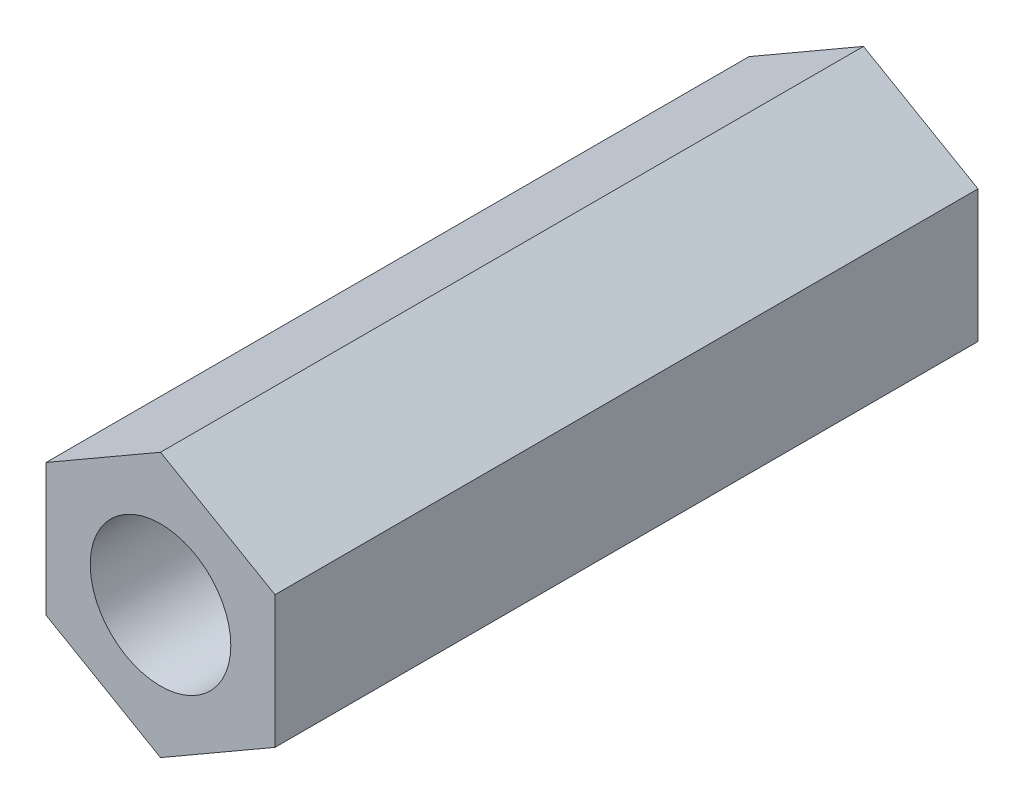
ISO-10303-21;
HEADER;
FILE_DESCRIPTION(('STEP AP214'),'2;1');
FILE_NAME('part.step','',(''),(''),'','','');
FILE_SCHEMA(('AUTOMOTIVE_DESIGN { 1 0 10303 214 1 1 1 1 }'));
ENDSEC;
DATA;
#1=APPLICATION_CONTEXT('core data for automotive mechanical design processes');
#2=APPLICATION_PROTOCOL_DEFINITION('international standard','automotive_design',2000,#1);
#3=PRODUCT_CONTEXT('',#1,'mechanical');
#4=PRODUCT('Part','Part','',(#3));
#5=PRODUCT_RELATED_PRODUCT_CATEGORY('part','',(#4));
#6=PRODUCT_DEFINITION_FORMATION('','',#4);
#7=PRODUCT_DEFINITION_CONTEXT('part definition',#1,'design');
#8=PRODUCT_DEFINITION('design','',#6,#7);
#9=PRODUCT_DEFINITION_SHAPE('','',#8);
#10=(LENGTH_UNIT() NAMED_UNIT(*) SI_UNIT(.MILLI.,.METRE.));
#11=(NAMED_UNIT(*) PLANE_ANGLE_UNIT() SI_UNIT($,.RADIAN.));
#12=(NAMED_UNIT(*) SI_UNIT($,.STERADIAN.) SOLID_ANGLE_UNIT());
#13=UNCERTAINTY_MEASURE_WITH_UNIT(LENGTH_MEASURE(1.E-05),#10,'distance_accuracy_value','');
#14=(GEOMETRIC_REPRESENTATION_CONTEXT(3) GLOBAL_UNCERTAINTY_ASSIGNED_CONTEXT((#13)) GLOBAL_UNIT_ASSIGNED_CONTEXT((#10,
#11,#12)) REPRESENTATION_CONTEXT('',''));
#15=CARTESIAN_POINT('',(0.,0.,0.));
#16=DIRECTION('',(0.,0.,1.));
#17=DIRECTION('',(1.,0.,0.));
#18=AXIS2_PLACEMENT_3D('',#15,#16,#17);
#19=CARTESIAN_POINT('',(0.,0.,15.));
#20=DIRECTION('',(0.,0.,1.));
#21=DIRECTION('',(1.,0.,0.));
#22=AXIS2_PLACEMENT_3D('',#19,#20,#21);
#23=PLANE('',#22);
#24=DIRECTION('',(-0.866025403784442,0.499999999999995,0.));
#25=VECTOR('',#24,1.);
#26=CARTESIAN_POINT('',(2.44342974290793,1.41071481981387,15.));
#27=LINE('',#26,#25);
#28=CARTESIAN_POINT('',(2.44342974290793,1.41071481981387,15.));
#29=VERTEX_POINT('',#28);
#30=CARTESIAN_POINT('',(0.,2.82142963962768,15.));
#31=VERTEX_POINT('',#30);
#32=EDGE_CURVE('E135',#29,#31,#27,.T.);
#33=ORIENTED_EDGE('',*,*,#32,.T.);
#34=DIRECTION('',(-0.866025403784438,-0.500000000000001,0.));
#35=VECTOR('',#34,1.);
#36=CARTESIAN_POINT('',(0.,2.82142963962768,15.));
#37=LINE('',#36,#35);
#38=CARTESIAN_POINT('',(-2.44342974290795,1.41071481981383,15.));
#39=VERTEX_POINT('',#38);
#40=EDGE_CURVE('E93',#31,#39,#37,.T.);
#41=ORIENTED_EDGE('',*,*,#40,.T.);
#42=DIRECTION('',(0.,-1.,0.));
#43=VECTOR('',#42,1.);
#44=CARTESIAN_POINT('',(-2.44342974290795,1.41071481981383,15.));
#45=LINE('',#44,#43);
#46=CARTESIAN_POINT('',(-2.44342974290794,-1.41071481981385,15.));
#47=VERTEX_POINT('',#46);
#48=EDGE_CURVE('E106',#39,#47,#45,.T.);
#49=ORIENTED_EDGE('',*,*,#48,.T.);
#50=DIRECTION('',(0.866025403784441,-0.499999999999995,0.));
#51=VECTOR('',#50,1.);
#52=CARTESIAN_POINT('',(-2.44342974290794,-1.41071481981385,15.));
#53=LINE('',#52,#51);
#54=CARTESIAN_POINT('',(0.,-2.82142963962768,15.));
#55=VERTEX_POINT('',#54);
#56=EDGE_CURVE('E100',#47,#55,#53,.T.);
#57=ORIENTED_EDGE('',*,*,#56,.T.);
#58=DIRECTION('',(0.866025403784435,0.500000000000007,0.));
#59=VECTOR('',#58,1.);
#60=CARTESIAN_POINT('',(0.,-2.82142963962768,15.));
#61=LINE('',#60,#59);
#62=CARTESIAN_POINT('',(2.44342974290796,-1.41071481981382,15.));
#63=VERTEX_POINT('',#62);
#64=EDGE_CURVE('E104',#55,#63,#61,.T.);
#65=ORIENTED_EDGE('',*,*,#64,.T.);
#66=DIRECTION('',(0.,1.,0.));
#67=VECTOR('',#66,1.);
#68=CARTESIAN_POINT('',(2.44342974290796,-1.41071481981382,15.));
#69=LINE('',#68,#67);
#70=EDGE_CURVE('E56',#63,#29,#69,.T.);
#71=ORIENTED_EDGE('',*,*,#70,.T.);
#72=EDGE_LOOP('',(#33,#41,#49,#57,#65,#71));
#73=FACE_BOUND('',#72,.T.);
#74=CARTESIAN_POINT('',(0.,0.,15.));
#75=DIRECTION('',(0.,0.,1.));
#76=DIRECTION('',(1.,0.,0.));
#77=AXIS2_PLACEMENT_3D('',#74,#75,#76);
#78=CIRCLE('',#77,1.5);
#79=CARTESIAN_POINT('',(1.5,0.,15.));
#80=VERTEX_POINT('',#79);
#81=EDGE_CURVE('E128',#80,#80,#78,.T.);
#82=ORIENTED_EDGE('',*,*,#81,.F.);
#83=EDGE_LOOP('',(#82));
#84=FACE_BOUND('',#83,.T.);
#85=ADVANCED_FACE('F39',(#73,#84),#23,.T.);
#86=CARTESIAN_POINT('',(0.,0.,0.));
#87=DIRECTION('',(0.,0.,1.));
#88=DIRECTION('',(1.,0.,0.));
#89=AXIS2_PLACEMENT_3D('',#86,#87,#88);
#90=PLANE('',#89);
#91=DIRECTION('',(-0.866025403784442,0.499999999999995,0.));
#92=VECTOR('',#91,1.);
#93=CARTESIAN_POINT('',(2.44342974290793,1.41071481981387,0.));
#94=LINE('',#93,#92);
#95=CARTESIAN_POINT('',(2.44342974290793,1.41071481981387,0.));
#96=VERTEX_POINT('',#95);
#97=CARTESIAN_POINT('',(0.,2.82142963962768,0.));
#98=VERTEX_POINT('',#97);
#99=EDGE_CURVE('E124',#96,#98,#94,.T.);
#100=ORIENTED_EDGE('',*,*,#99,.F.);
#101=DIRECTION('',(0.,1.,0.));
#102=VECTOR('',#101,1.);
#103=CARTESIAN_POINT('',(2.44342974290796,-1.41071481981382,0.));
#104=LINE('',#103,#102);
#105=CARTESIAN_POINT('',(2.44342974290796,-1.41071481981382,0.));
#106=VERTEX_POINT('',#105);
#107=EDGE_CURVE('E85',#106,#96,#104,.T.);
#108=ORIENTED_EDGE('',*,*,#107,.F.);
#109=DIRECTION('',(0.866025403784435,0.500000000000007,0.));
#110=VECTOR('',#109,1.);
#111=CARTESIAN_POINT('',(0.,-2.82142963962768,0.));
#112=LINE('',#111,#110);
#113=CARTESIAN_POINT('',(0.,-2.82142963962768,0.));
#114=VERTEX_POINT('',#113);
#115=EDGE_CURVE('E79',#114,#106,#112,.T.);
#116=ORIENTED_EDGE('',*,*,#115,.F.);
#117=DIRECTION('',(0.866025403784441,-0.499999999999995,0.));
#118=VECTOR('',#117,1.);
#119=CARTESIAN_POINT('',(-2.44342974290794,-1.41071481981385,0.));
#120=LINE('',#119,#118);
#121=CARTESIAN_POINT('',(-2.44342974290794,-1.41071481981385,0.));
#122=VERTEX_POINT('',#121);
#123=EDGE_CURVE('E114',#122,#114,#120,.T.);
#124=ORIENTED_EDGE('',*,*,#123,.F.);
#125=DIRECTION('',(0.,-1.,0.));
#126=VECTOR('',#125,1.);
#127=CARTESIAN_POINT('',(-2.44342974290795,1.41071481981383,0.));
#128=LINE('',#127,#126);
#129=CARTESIAN_POINT('',(-2.44342974290795,1.41071481981383,0.));
#130=VERTEX_POINT('',#129);
#131=EDGE_CURVE('E130',#130,#122,#128,.T.);
#132=ORIENTED_EDGE('',*,*,#131,.F.);
#133=DIRECTION('',(-0.866025403784438,-0.500000000000001,0.));
#134=VECTOR('',#133,1.);
#135=CARTESIAN_POINT('',(0.,2.82142963962768,0.));
#136=LINE('',#135,#134);
#137=EDGE_CURVE('E127',#98,#130,#136,.T.);
#138=ORIENTED_EDGE('',*,*,#137,.F.);
#139=EDGE_LOOP('',(#100,#108,#116,#124,#132,#138));
#140=FACE_BOUND('',#139,.T.);
#141=CARTESIAN_POINT('',(0.,0.,0.));
#142=DIRECTION('',(0.,0.,1.));
#143=DIRECTION('',(1.,0.,0.));
#144=AXIS2_PLACEMENT_3D('',#141,#142,#143);
#145=CIRCLE('',#144,1.5);
#146=CARTESIAN_POINT('',(1.5,0.,0.));
#147=VERTEX_POINT('',#146);
#148=EDGE_CURVE('E228',#147,#147,#145,.T.);
#149=ORIENTED_EDGE('',*,*,#148,.T.);
#150=EDGE_LOOP('',(#149));
#151=FACE_BOUND('',#150,.T.);
#152=ADVANCED_FACE('F144',(#140,#151),#90,.F.);
#153=CARTESIAN_POINT('',(2.44342974290793,1.41071481981387,15.));
#154=DIRECTION('',(-0.499999999999995,-0.866025403784442,0.));
#155=DIRECTION('',(0.866025403784442,-0.499999999999995,0.));
#156=AXIS2_PLACEMENT_3D('',#153,#154,#155);
#157=PLANE('',#156);
#158=ORIENTED_EDGE('',*,*,#99,.T.);
#159=DIRECTION('',(0.,0.,-1.));
#160=VECTOR('',#159,1.);
#161=CARTESIAN_POINT('',(0.,2.82142963962768,15.));
#162=LINE('',#161,#160);
#163=EDGE_CURVE('E11',#31,#98,#162,.T.);
#164=ORIENTED_EDGE('',*,*,#163,.F.);
#165=ORIENTED_EDGE('',*,*,#32,.F.);
#166=DIRECTION('',(0.,0.,-1.));
#167=VECTOR('',#166,1.);
#168=CARTESIAN_POINT('',(2.44342974290793,1.41071481981387,15.));
#169=LINE('',#168,#167);
#170=EDGE_CURVE('E120',#29,#96,#169,.T.);
#171=ORIENTED_EDGE('',*,*,#170,.T.);
#172=EDGE_LOOP('',(#158,#164,#165,#171));
#173=FACE_BOUND('',#172,.T.);
#174=ADVANCED_FACE('F41',(#173),#157,.F.);
#175=CARTESIAN_POINT('',(0.,2.82142963962768,15.));
#176=DIRECTION('',(0.500000000000001,-0.866025403784438,0.));
#177=DIRECTION('',(0.866025403784438,0.500000000000001,0.));
#178=AXIS2_PLACEMENT_3D('',#175,#176,#177);
#179=PLANE('',#178);
#180=ORIENTED_EDGE('',*,*,#137,.T.);
#181=DIRECTION('',(0.,0.,-1.));
#182=VECTOR('',#181,1.);
#183=CARTESIAN_POINT('',(-2.44342974290795,1.41071481981383,15.));
#184=LINE('',#183,#182);
#185=EDGE_CURVE('E48',#39,#130,#184,.T.);
#186=ORIENTED_EDGE('',*,*,#185,.F.);
#187=ORIENTED_EDGE('',*,*,#40,.F.);
#188=ORIENTED_EDGE('',*,*,#163,.T.);
#189=EDGE_LOOP('',(#180,#186,#187,#188));
#190=FACE_BOUND('',#189,.T.);
#191=ADVANCED_FACE('F169',(#190),#179,.F.);
#192=CARTESIAN_POINT('',(-2.44342974290795,1.41071481981383,15.));
#193=DIRECTION('',(1.,0.,0.));
#194=DIRECTION('',(0.,1.,0.));
#195=AXIS2_PLACEMENT_3D('',#192,#193,#194);
#196=PLANE('',#195);
#197=ORIENTED_EDGE('',*,*,#131,.T.);
#198=DIRECTION('',(0.,0.,-1.));
#199=VECTOR('',#198,1.);
#200=CARTESIAN_POINT('',(-2.44342974290794,-1.41071481981385,15.));
#201=LINE('',#200,#199);
#202=EDGE_CURVE('E115',#47,#122,#201,.T.);
#203=ORIENTED_EDGE('',*,*,#202,.F.);
#204=ORIENTED_EDGE('',*,*,#48,.F.);
#205=ORIENTED_EDGE('',*,*,#185,.T.);
#206=EDGE_LOOP('',(#197,#203,#204,#205));
#207=FACE_BOUND('',#206,.T.);
#208=ADVANCED_FACE('F141',(#207),#196,.F.);
#209=CARTESIAN_POINT('',(-2.44342974290794,-1.41071481981385,15.));
#210=DIRECTION('',(0.499999999999995,0.866025403784441,0.));
#211=DIRECTION('',(-0.866025403784441,0.499999999999995,0.));
#212=AXIS2_PLACEMENT_3D('',#209,#210,#211);
#213=PLANE('',#212);
#214=ORIENTED_EDGE('',*,*,#123,.T.);
#215=DIRECTION('',(0.,0.,-1.));
#216=VECTOR('',#215,1.);
#217=CARTESIAN_POINT('',(0.,-2.82142963962768,15.));
#218=LINE('',#217,#216);
#219=EDGE_CURVE('E111',#55,#114,#218,.T.);
#220=ORIENTED_EDGE('',*,*,#219,.F.);
#221=ORIENTED_EDGE('',*,*,#56,.F.);
#222=ORIENTED_EDGE('',*,*,#202,.T.);
#223=EDGE_LOOP('',(#214,#220,#221,#222));
#224=FACE_BOUND('',#223,.T.);
#225=ADVANCED_FACE('F112',(#224),#213,.F.);
#226=CARTESIAN_POINT('',(0.,-2.82142963962768,15.));
#227=DIRECTION('',(-0.500000000000007,0.866025403784435,0.));
#228=DIRECTION('',(-0.866025403784435,-0.500000000000007,0.));
#229=AXIS2_PLACEMENT_3D('',#226,#227,#228);
#230=PLANE('',#229);
#231=ORIENTED_EDGE('',*,*,#115,.T.);
#232=DIRECTION('',(0.,0.,-1.));
#233=VECTOR('',#232,1.);
#234=CARTESIAN_POINT('',(2.44342974290796,-1.41071481981382,15.));
#235=LINE('',#234,#233);
#236=EDGE_CURVE('E116',#63,#106,#235,.T.);
#237=ORIENTED_EDGE('',*,*,#236,.F.);
#238=ORIENTED_EDGE('',*,*,#64,.F.);
#239=ORIENTED_EDGE('',*,*,#219,.T.);
#240=EDGE_LOOP('',(#231,#237,#238,#239));
#241=FACE_BOUND('',#240,.T.);
#242=ADVANCED_FACE('F118',(#241),#230,.F.);
#243=CARTESIAN_POINT('',(2.44342974290796,-1.41071481981382,15.));
#244=DIRECTION('',(-1.,0.,0.));
#245=DIRECTION('',(0.,-1.,0.));
#246=AXIS2_PLACEMENT_3D('',#243,#244,#245);
#247=PLANE('',#246);
#248=ORIENTED_EDGE('',*,*,#107,.T.);
#249=ORIENTED_EDGE('',*,*,#170,.F.);
#250=ORIENTED_EDGE('',*,*,#70,.F.);
#251=ORIENTED_EDGE('',*,*,#236,.T.);
#252=EDGE_LOOP('',(#248,#249,#250,#251));
#253=FACE_BOUND('',#252,.T.);
#254=ADVANCED_FACE('F149',(#253),#247,.F.);
#255=CARTESIAN_POINT('',(0.,0.,15.));
#256=DIRECTION('',(0.,0.,-1.));
#257=DIRECTION('',(-1.,0.,0.));
#258=AXIS2_PLACEMENT_3D('',#255,#256,#257);
#259=CYLINDRICAL_SURFACE('',#258,1.5);
#260=ORIENTED_EDGE('',*,*,#81,.T.);
#261=EDGE_LOOP('',(#260));
#262=FACE_BOUND('',#261,.T.);
#263=ORIENTED_EDGE('',*,*,#148,.F.);
#264=EDGE_LOOP('',(#263));
#265=FACE_BOUND('',#264,.T.);
#266=ADVANCED_FACE('F151',(#262,#265),#259,.F.);
#267=CLOSED_SHELL('',(#85,#152,#174,#191,#208,#225,#242,#254,#266));
#268=MANIFOLD_SOLID_BREP('B2',#267);
#269=ADVANCED_BREP_SHAPE_REPRESENTATION('',(#18,#268),#14);
#270=SHAPE_DEFINITION_REPRESENTATION(#9,#269);
ENDSEC;
END-ISO-10303-21;
